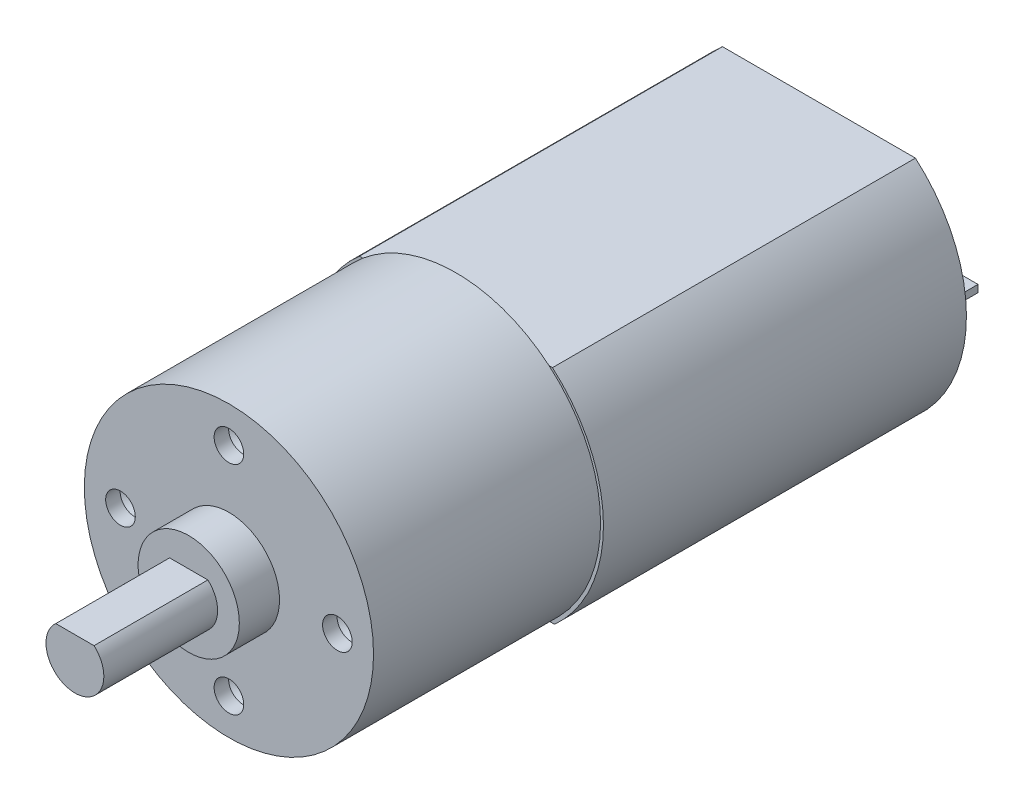
ISO-10303-21;
HEADER;
FILE_DESCRIPTION(('STEP AP214'),'2;1');
FILE_NAME('part.step','',(''),(''),'','','');
FILE_SCHEMA(('AUTOMOTIVE_DESIGN { 1 0 10303 214 1 1 1 1 }'));
ENDSEC;
DATA;
#1=APPLICATION_CONTEXT('core data for automotive mechanical design processes');
#2=APPLICATION_PROTOCOL_DEFINITION('international standard','automotive_design',2000,#1);
#3=PRODUCT_CONTEXT('',#1,'mechanical');
#4=PRODUCT('Part','Part','',(#3));
#5=PRODUCT_RELATED_PRODUCT_CATEGORY('part','',(#4));
#6=PRODUCT_DEFINITION_FORMATION('','',#4);
#7=PRODUCT_DEFINITION_CONTEXT('part definition',#1,'design');
#8=PRODUCT_DEFINITION('design','',#6,#7);
#9=PRODUCT_DEFINITION_SHAPE('','',#8);
#10=(LENGTH_UNIT() NAMED_UNIT(*) SI_UNIT(.MILLI.,.METRE.));
#11=(NAMED_UNIT(*) PLANE_ANGLE_UNIT() SI_UNIT($,.RADIAN.));
#12=(NAMED_UNIT(*) SI_UNIT($,.STERADIAN.) SOLID_ANGLE_UNIT());
#13=UNCERTAINTY_MEASURE_WITH_UNIT(LENGTH_MEASURE(1.E-05),#10,'distance_accuracy_value','');
#14=(GEOMETRIC_REPRESENTATION_CONTEXT(3) GLOBAL_UNCERTAINTY_ASSIGNED_CONTEXT((#13)) GLOBAL_UNIT_ASSIGNED_CONTEXT((#10,
#11,#12)) REPRESENTATION_CONTEXT('',''));
#15=CARTESIAN_POINT('',(0.,0.,0.));
#16=DIRECTION('',(0.,0.,1.));
#17=DIRECTION('',(1.,0.,0.));
#18=AXIS2_PLACEMENT_3D('',#15,#16,#17);
#19=CARTESIAN_POINT('',(0.,-0.0637574717630147,-25.1));
#20=DIRECTION('',(0.,0.,-1.));
#21=DIRECTION('',(-1.,0.,0.));
#22=AXIS2_PLACEMENT_3D('',#19,#20,#21);
#23=PLANE('',#22);
#24=DIRECTION('',(-1.,0.,0.));
#25=VECTOR('',#24,1.);
#26=CARTESIAN_POINT('',(6.64,-0.249999999999998,-25.1));
#27=LINE('',#26,#25);
#28=CARTESIAN_POINT('',(9.,-0.249999999999999,-25.1));
#29=VERTEX_POINT('',#28);
#30=CARTESIAN_POINT('',(6.64,-0.249999999999998,-25.1));
#31=VERTEX_POINT('',#30);
#32=EDGE_CURVE('E243',#29,#31,#27,.T.);
#33=ORIENTED_EDGE('',*,*,#32,.F.);
#34=DIRECTION('',(0.,-1.,0.));
#35=VECTOR('',#34,1.);
#36=CARTESIAN_POINT('',(9.,-0.249999999999999,-25.1));
#37=LINE('',#36,#35);
#38=CARTESIAN_POINT('',(9.,0.250000000000001,-25.1));
#39=VERTEX_POINT('',#38);
#40=EDGE_CURVE('E229',#39,#29,#37,.T.);
#41=ORIENTED_EDGE('',*,*,#40,.F.);
#42=DIRECTION('',(1.,0.,0.));
#43=VECTOR('',#42,1.);
#44=CARTESIAN_POINT('',(6.64,0.250000000000002,-25.1));
#45=LINE('',#44,#43);
#46=CARTESIAN_POINT('',(6.64,0.250000000000002,-25.1));
#47=VERTEX_POINT('',#46);
#48=EDGE_CURVE('E234',#47,#39,#45,.T.);
#49=ORIENTED_EDGE('',*,*,#48,.F.);
#50=DIRECTION('',(0.,1.,0.));
#51=VECTOR('',#50,1.);
#52=CARTESIAN_POINT('',(6.64,-0.249999999999998,-25.1));
#53=LINE('',#52,#51);
#54=EDGE_CURVE('E245',#31,#47,#53,.T.);
#55=ORIENTED_EDGE('',*,*,#54,.F.);
#56=EDGE_LOOP('',(#33,#41,#49,#55));
#57=FACE_BOUND('',#56,.T.);
#58=CARTESIAN_POINT('',(0.,-0.0637574717630147,-25.1));
#59=DIRECTION('',(0.,0.,-1.));
#60=DIRECTION('',(-1.,0.,0.));
#61=AXIS2_PLACEMENT_3D('',#58,#59,#60);
#62=CIRCLE('',#61,10.20045545372);
#63=CARTESIAN_POINT('',(6.67437166556878,7.65,-25.1));
#64=VERTEX_POINT('',#63);
#65=CARTESIAN_POINT('',(6.81896002086063,-7.65,-25.1));
#66=VERTEX_POINT('',#65);
#67=EDGE_CURVE('E284',#64,#66,#62,.T.);
#68=ORIENTED_EDGE('',*,*,#67,.T.);
#69=DIRECTION('',(-1.,0.,0.));
#70=VECTOR('',#69,1.);
#71=CARTESIAN_POINT('',(6.81896002086063,-7.65,-25.1));
#72=LINE('',#71,#70);
#73=CARTESIAN_POINT('',(-6.81896002086062,-7.65,-25.1));
#74=VERTEX_POINT('',#73);
#75=EDGE_CURVE('E287',#66,#74,#72,.T.);
#76=ORIENTED_EDGE('',*,*,#75,.T.);
#77=CARTESIAN_POINT('',(0.,-0.0637574717630147,-25.1));
#78=DIRECTION('',(0.,0.,-1.));
#79=DIRECTION('',(-1.,0.,0.));
#80=AXIS2_PLACEMENT_3D('',#77,#78,#79);
#81=CIRCLE('',#80,10.20045545372);
#82=CARTESIAN_POINT('',(-6.67437166556877,7.65,-25.1));
#83=VERTEX_POINT('',#82);
#84=EDGE_CURVE('E289',#74,#83,#81,.T.);
#85=ORIENTED_EDGE('',*,*,#84,.T.);
#86=DIRECTION('',(1.,0.,0.));
#87=VECTOR('',#86,1.);
#88=CARTESIAN_POINT('',(6.67437166556878,7.65,-25.1));
#89=LINE('',#88,#87);
#90=EDGE_CURVE('E291',#83,#64,#89,.T.);
#91=ORIENTED_EDGE('',*,*,#90,.T.);
#92=EDGE_LOOP('',(#68,#76,#85,#91));
#93=FACE_BOUND('',#92,.T.);
#94=CARTESIAN_POINT('',(0.,0.,-25.1));
#95=DIRECTION('',(0.,0.,-1.));
#96=DIRECTION('',(-1.,0.,0.));
#97=AXIS2_PLACEMENT_3D('',#94,#95,#96);
#98=CIRCLE('',#97,3.02);
#99=CARTESIAN_POINT('',(-3.02,0.,-25.1));
#100=VERTEX_POINT('',#99);
#101=EDGE_CURVE('E256',#100,#100,#98,.T.);
#102=ORIENTED_EDGE('',*,*,#101,.F.);
#103=EDGE_LOOP('',(#102));
#104=FACE_BOUND('',#103,.T.);
#105=DIRECTION('',(-1.,0.,0.));
#106=VECTOR('',#105,1.);
#107=CARTESIAN_POINT('',(-6.64,-0.249999999999998,-25.1));
#108=LINE('',#107,#106);
#109=CARTESIAN_POINT('',(-6.64,-0.249999999999998,-25.1));
#110=VERTEX_POINT('',#109);
#111=CARTESIAN_POINT('',(-9.,-0.249999999999999,-25.1));
#112=VERTEX_POINT('',#111);
#113=EDGE_CURVE('E216',#110,#112,#108,.T.);
#114=ORIENTED_EDGE('',*,*,#113,.F.);
#115=DIRECTION('',(0.,-1.,0.));
#116=VECTOR('',#115,1.);
#117=CARTESIAN_POINT('',(-6.64,-0.249999999999998,-25.1));
#118=LINE('',#117,#116);
#119=CARTESIAN_POINT('',(-6.64,0.250000000000002,-25.1));
#120=VERTEX_POINT('',#119);
#121=EDGE_CURVE('E202',#120,#110,#118,.T.);
#122=ORIENTED_EDGE('',*,*,#121,.F.);
#123=DIRECTION('',(1.,0.,0.));
#124=VECTOR('',#123,1.);
#125=CARTESIAN_POINT('',(-6.64,0.250000000000002,-25.1));
#126=LINE('',#125,#124);
#127=CARTESIAN_POINT('',(-9.,0.250000000000001,-25.1));
#128=VERTEX_POINT('',#127);
#129=EDGE_CURVE('E207',#128,#120,#126,.T.);
#130=ORIENTED_EDGE('',*,*,#129,.F.);
#131=DIRECTION('',(0.,1.,0.));
#132=VECTOR('',#131,1.);
#133=CARTESIAN_POINT('',(-9.,-0.249999999999999,-25.1));
#134=LINE('',#133,#132);
#135=EDGE_CURVE('E218',#112,#128,#134,.T.);
#136=ORIENTED_EDGE('',*,*,#135,.F.);
#137=EDGE_LOOP('',(#114,#122,#130,#136));
#138=FACE_BOUND('',#137,.T.);
#139=ADVANCED_FACE('F40',(#57,#93,#104,#138),#23,.T.);
#140=CARTESIAN_POINT('',(0.,0.,18.48));
#141=DIRECTION('',(0.,0.,1.));
#142=DIRECTION('',(1.,0.,0.));
#143=AXIS2_PLACEMENT_3D('',#140,#141,#142);
#144=PLANE('',#143);
#145=CARTESIAN_POINT('',(0.,0.,18.48));
#146=DIRECTION('',(0.,0.,1.));
#147=DIRECTION('',(1.,0.,0.));
#148=AXIS2_PLACEMENT_3D('',#145,#146,#147);
#149=CIRCLE('',#148,3.5);
#150=CARTESIAN_POINT('',(3.5,0.,18.48));
#151=VERTEX_POINT('',#150);
#152=EDGE_CURVE('E278',#151,#151,#149,.T.);
#153=ORIENTED_EDGE('',*,*,#152,.T.);
#154=EDGE_LOOP('',(#153));
#155=FACE_BOUND('',#154,.T.);
#156=DIRECTION('',(-1.,0.,0.));
#157=VECTOR('',#156,1.);
#158=CARTESIAN_POINT('',(-1.3228756555323,1.5,18.48));
#159=LINE('',#158,#157);
#160=CARTESIAN_POINT('',(1.3228756555323,1.5,18.48));
#161=VERTEX_POINT('',#160);
#162=CARTESIAN_POINT('',(-1.3228756555323,1.5,18.48));
#163=VERTEX_POINT('',#162);
#164=EDGE_CURVE('E267',#161,#163,#159,.T.);
#165=ORIENTED_EDGE('',*,*,#164,.F.);
#166=CARTESIAN_POINT('',(0.,0.,18.48));
#167=DIRECTION('',(0.,0.,1.));
#168=DIRECTION('',(1.,0.,0.));
#169=AXIS2_PLACEMENT_3D('',#166,#167,#168);
#170=CIRCLE('',#169,2.);
#171=EDGE_CURVE('E260',#163,#161,#170,.T.);
#172=ORIENTED_EDGE('',*,*,#171,.F.);
#173=EDGE_LOOP('',(#165,#172));
#174=FACE_BOUND('',#173,.T.);
#175=ADVANCED_FACE('F355',(#155,#174),#144,.T.);
#176=CARTESIAN_POINT('',(0.,0.,15.7));
#177=DIRECTION('',(0.,0.,1.));
#178=DIRECTION('',(1.,0.,0.));
#179=AXIS2_PLACEMENT_3D('',#176,#177,#178);
#180=PLANE('',#179);
#181=CARTESIAN_POINT('',(-7.5,0.,15.7));
#182=DIRECTION('',(0.,0.,1.));
#183=DIRECTION('',(1.,0.,0.));
#184=AXIS2_PLACEMENT_3D('',#181,#182,#183);
#185=CIRCLE('',#184,1.025);
#186=CARTESIAN_POINT('',(-6.475,0.,15.7));
#187=VERTEX_POINT('',#186);
#188=EDGE_CURVE('E180',#187,#187,#185,.T.);
#189=ORIENTED_EDGE('',*,*,#188,.F.);
#190=EDGE_LOOP('',(#189));
#191=FACE_BOUND('',#190,.T.);
#192=CARTESIAN_POINT('',(7.5,0.,15.7));
#193=DIRECTION('',(0.,0.,1.));
#194=DIRECTION('',(1.,0.,0.));
#195=AXIS2_PLACEMENT_3D('',#192,#193,#194);
#196=CIRCLE('',#195,1.025);
#197=CARTESIAN_POINT('',(8.525,0.,15.7));
#198=VERTEX_POINT('',#197);
#199=EDGE_CURVE('E179',#198,#198,#196,.T.);
#200=ORIENTED_EDGE('',*,*,#199,.F.);
#201=EDGE_LOOP('',(#200));
#202=FACE_BOUND('',#201,.T.);
#203=CARTESIAN_POINT('',(0.,7.5,15.7));
#204=DIRECTION('',(0.,0.,1.));
#205=DIRECTION('',(1.,0.,0.));
#206=AXIS2_PLACEMENT_3D('',#203,#204,#205);
#207=CIRCLE('',#206,1.025);
#208=CARTESIAN_POINT('',(1.025,7.5,15.7));
#209=VERTEX_POINT('',#208);
#210=EDGE_CURVE('E190',#209,#209,#207,.T.);
#211=ORIENTED_EDGE('',*,*,#210,.F.);
#212=EDGE_LOOP('',(#211));
#213=FACE_BOUND('',#212,.T.);
#214=CARTESIAN_POINT('',(0.,-7.5,15.7));
#215=DIRECTION('',(0.,0.,1.));
#216=DIRECTION('',(1.,0.,0.));
#217=AXIS2_PLACEMENT_3D('',#214,#215,#216);
#218=CIRCLE('',#217,1.025);
#219=CARTESIAN_POINT('',(1.025,-7.5,15.7));
#220=VERTEX_POINT('',#219);
#221=EDGE_CURVE('E196',#220,#220,#218,.T.);
#222=ORIENTED_EDGE('',*,*,#221,.F.);
#223=EDGE_LOOP('',(#222));
#224=FACE_BOUND('',#223,.T.);
#225=CARTESIAN_POINT('',(0.,0.,15.7));
#226=DIRECTION('',(0.,0.,1.));
#227=DIRECTION('',(1.,0.,0.));
#228=AXIS2_PLACEMENT_3D('',#225,#226,#227);
#229=CIRCLE('',#228,10.);
#230=CARTESIAN_POINT('',(10.,0.,15.7));
#231=VERTEX_POINT('',#230);
#232=EDGE_CURVE('E314',#231,#231,#229,.T.);
#233=ORIENTED_EDGE('',*,*,#232,.T.);
#234=EDGE_LOOP('',(#233));
#235=FACE_BOUND('',#234,.T.);
#236=CARTESIAN_POINT('',(0.,0.,15.7));
#237=DIRECTION('',(0.,0.,1.));
#238=DIRECTION('',(1.,0.,0.));
#239=AXIS2_PLACEMENT_3D('',#236,#237,#238);
#240=CIRCLE('',#239,3.5);
#241=CARTESIAN_POINT('',(3.5,0.,15.7));
#242=VERTEX_POINT('',#241);
#243=EDGE_CURVE('E277',#242,#242,#240,.T.);
#244=ORIENTED_EDGE('',*,*,#243,.F.);
#245=EDGE_LOOP('',(#244));
#246=FACE_BOUND('',#245,.T.);
#247=ADVANCED_FACE('F350',(#191,#202,#213,#224,#235,#246),#180,.T.);
#248=CARTESIAN_POINT('',(0.,0.,0.));
#249=DIRECTION('',(0.,0.,1.));
#250=DIRECTION('',(1.,0.,0.));
#251=AXIS2_PLACEMENT_3D('',#248,#249,#250);
#252=PLANE('',#251);
#253=DIRECTION('',(1.,0.,0.));
#254=VECTOR('',#253,1.);
#255=CARTESIAN_POINT('',(6.67437166556878,7.65,0.));
#256=LINE('',#255,#254);
#257=CARTESIAN_POINT('',(-6.440302787913,7.65,0.));
#258=VERTEX_POINT('',#257);
#259=CARTESIAN_POINT('',(6.440302787913,7.65,0.));
#260=VERTEX_POINT('',#259);
#261=EDGE_CURVE('E12',#258,#260,#256,.T.);
#262=ORIENTED_EDGE('',*,*,#261,.F.);
#263=CARTESIAN_POINT('',(0.,0.,0.));
#264=DIRECTION('',(0.,0.,1.));
#265=DIRECTION('',(1.,0.,0.));
#266=AXIS2_PLACEMENT_3D('',#263,#264,#265);
#267=CIRCLE('',#266,10.);
#268=EDGE_CURVE('E44',#260,#258,#267,.T.);
#269=ORIENTED_EDGE('',*,*,#268,.F.);
#270=EDGE_LOOP('',(#262,#269));
#271=FACE_BOUND('',#270,.T.);
#272=ADVANCED_FACE('F347',(#271),#252,.F.);
#273=DIRECTION('',(-1.,0.,0.));
#274=VECTOR('',#273,1.);
#275=CARTESIAN_POINT('',(6.81896002086063,-7.65,0.));
#276=LINE('',#275,#274);
#277=CARTESIAN_POINT('',(6.440302787913,-7.65,0.));
#278=VERTEX_POINT('',#277);
#279=CARTESIAN_POINT('',(-6.44030278791301,-7.65,0.));
#280=VERTEX_POINT('',#279);
#281=EDGE_CURVE('E49',#278,#280,#276,.T.);
#282=ORIENTED_EDGE('',*,*,#281,.F.);
#283=EDGE_CURVE('E324',#280,#278,#267,.T.);
#284=ORIENTED_EDGE('',*,*,#283,.F.);
#285=EDGE_LOOP('',(#282,#284));
#286=FACE_BOUND('',#285,.T.);
#287=ADVANCED_FACE('F349',(#286),#252,.F.);
#288=CARTESIAN_POINT('',(0.,0.,15.7));
#289=DIRECTION('',(0.,0.,-1.));
#290=DIRECTION('',(-1.,0.,0.));
#291=AXIS2_PLACEMENT_3D('',#288,#289,#290);
#292=CYLINDRICAL_SURFACE('',#291,10.);
#293=ORIENTED_EDGE('',*,*,#232,.F.);
#294=EDGE_LOOP('',(#293));
#295=FACE_BOUND('',#294,.T.);
#296=ORIENTED_EDGE('',*,*,#268,.T.);
#297=EDGE_CURVE('E320',#258,#280,#267,.T.);
#298=ORIENTED_EDGE('',*,*,#297,.T.);
#299=ORIENTED_EDGE('',*,*,#283,.T.);
#300=EDGE_CURVE('E313',#278,#260,#267,.T.);
#301=ORIENTED_EDGE('',*,*,#300,.T.);
#302=EDGE_LOOP('',(#296,#298,#299,#301));
#303=FACE_BOUND('',#302,.T.);
#304=ADVANCED_FACE('F42',(#295,#303),#292,.T.);
#305=CARTESIAN_POINT('',(0.,-0.0637574717630147,0.));
#306=DIRECTION('',(0.,0.,-1.));
#307=DIRECTION('',(-1.,0.,0.));
#308=AXIS2_PLACEMENT_3D('',#305,#306,#307);
#309=PLANE('',#308);
#310=ORIENTED_EDGE('',*,*,#297,.F.);
#311=CARTESIAN_POINT('',(-6.67437166556877,7.65,0.));
#312=VERTEX_POINT('',#311);
#313=EDGE_CURVE('E51',#312,#258,#256,.T.);
#314=ORIENTED_EDGE('',*,*,#313,.F.);
#315=CARTESIAN_POINT('',(0.,-0.0637574717630147,0.));
#316=DIRECTION('',(0.,0.,-1.));
#317=DIRECTION('',(-1.,0.,0.));
#318=AXIS2_PLACEMENT_3D('',#315,#316,#317);
#319=CIRCLE('',#318,10.20045545372);
#320=CARTESIAN_POINT('',(-6.81896002086062,-7.65,0.));
#321=VERTEX_POINT('',#320);
#322=EDGE_CURVE('E300',#321,#312,#319,.T.);
#323=ORIENTED_EDGE('',*,*,#322,.F.);
#324=EDGE_CURVE('E296',#280,#321,#276,.T.);
#325=ORIENTED_EDGE('',*,*,#324,.F.);
#326=EDGE_LOOP('',(#310,#314,#323,#325));
#327=FACE_BOUND('',#326,.T.);
#328=ADVANCED_FACE('F373',(#327),#309,.F.);
#329=CARTESIAN_POINT('',(0.,-0.0637574717630147,-25.1));
#330=DIRECTION('',(0.,0.,1.));
#331=DIRECTION('',(1.,0.,0.));
#332=AXIS2_PLACEMENT_3D('',#329,#330,#331);
#333=CYLINDRICAL_SURFACE('',#332,10.20045545372);
#334=CARTESIAN_POINT('',(0.,-0.0637574717630147,0.));
#335=DIRECTION('',(0.,0.,-1.));
#336=DIRECTION('',(-1.,0.,0.));
#337=AXIS2_PLACEMENT_3D('',#334,#335,#336);
#338=CIRCLE('',#337,10.20045545372);
#339=CARTESIAN_POINT('',(6.67437166556878,7.65,0.));
#340=VERTEX_POINT('',#339);
#341=CARTESIAN_POINT('',(6.81896002086063,-7.65,0.));
#342=VERTEX_POINT('',#341);
#343=EDGE_CURVE('E281',#340,#342,#338,.T.);
#344=ORIENTED_EDGE('',*,*,#343,.T.);
#345=DIRECTION('',(0.,0.,1.));
#346=VECTOR('',#345,1.);
#347=CARTESIAN_POINT('',(6.81896002086063,-7.65,-25.1));
#348=LINE('',#347,#346);
#349=EDGE_CURVE('E311',#66,#342,#348,.T.);
#350=ORIENTED_EDGE('',*,*,#349,.F.);
#351=ORIENTED_EDGE('',*,*,#67,.F.);
#352=DIRECTION('',(0.,0.,1.));
#353=VECTOR('',#352,1.);
#354=CARTESIAN_POINT('',(6.67437166556878,7.65,-25.1));
#355=LINE('',#354,#353);
#356=EDGE_CURVE('E293',#64,#340,#355,.T.);
#357=ORIENTED_EDGE('',*,*,#356,.T.);
#358=EDGE_LOOP('',(#344,#350,#351,#357));
#359=FACE_BOUND('',#358,.T.);
#360=ADVANCED_FACE('F340',(#359),#333,.T.);
#361=CARTESIAN_POINT('',(6.81896002086063,-7.65,-25.1));
#362=DIRECTION('',(0.,1.,0.));
#363=DIRECTION('',(-1.,0.,0.));
#364=AXIS2_PLACEMENT_3D('',#361,#362,#363);
#365=PLANE('',#364);
#366=EDGE_CURVE('E297',#342,#278,#276,.T.);
#367=ORIENTED_EDGE('',*,*,#366,.T.);
#368=ORIENTED_EDGE('',*,*,#281,.T.);
#369=ORIENTED_EDGE('',*,*,#324,.T.);
#370=DIRECTION('',(0.,0.,1.));
#371=VECTOR('',#370,1.);
#372=CARTESIAN_POINT('',(-6.81896002086062,-7.65,-25.1));
#373=LINE('',#372,#371);
#374=EDGE_CURVE('E308',#74,#321,#373,.T.);
#375=ORIENTED_EDGE('',*,*,#374,.F.);
#376=ORIENTED_EDGE('',*,*,#75,.F.);
#377=ORIENTED_EDGE('',*,*,#349,.T.);
#378=EDGE_LOOP('',(#367,#368,#369,#375,#376,#377));
#379=FACE_BOUND('',#378,.T.);
#380=ADVANCED_FACE('F335',(#379),#365,.F.);
#381=CARTESIAN_POINT('',(0.,-0.0637574717630147,-25.1));
#382=DIRECTION('',(0.,0.,1.));
#383=DIRECTION('',(1.,0.,0.));
#384=AXIS2_PLACEMENT_3D('',#381,#382,#383);
#385=CYLINDRICAL_SURFACE('',#384,10.20045545372);
#386=ORIENTED_EDGE('',*,*,#322,.T.);
#387=DIRECTION('',(0.,0.,1.));
#388=VECTOR('',#387,1.);
#389=CARTESIAN_POINT('',(-6.67437166556877,7.65,-25.1));
#390=LINE('',#389,#388);
#391=EDGE_CURVE('E305',#83,#312,#390,.T.);
#392=ORIENTED_EDGE('',*,*,#391,.F.);
#393=ORIENTED_EDGE('',*,*,#84,.F.);
#394=ORIENTED_EDGE('',*,*,#374,.T.);
#395=EDGE_LOOP('',(#386,#392,#393,#394));
#396=FACE_BOUND('',#395,.T.);
#397=ADVANCED_FACE('F376',(#396),#385,.T.);
#398=CARTESIAN_POINT('',(6.67437166556878,7.65,-25.1));
#399=DIRECTION('',(0.,-1.,0.));
#400=DIRECTION('',(1.,0.,0.));
#401=AXIS2_PLACEMENT_3D('',#398,#399,#400);
#402=PLANE('',#401);
#403=ORIENTED_EDGE('',*,*,#313,.T.);
#404=ORIENTED_EDGE('',*,*,#261,.T.);
#405=EDGE_CURVE('E52',#260,#340,#256,.T.);
#406=ORIENTED_EDGE('',*,*,#405,.T.);
#407=ORIENTED_EDGE('',*,*,#356,.F.);
#408=ORIENTED_EDGE('',*,*,#90,.F.);
#409=ORIENTED_EDGE('',*,*,#391,.T.);
#410=EDGE_LOOP('',(#403,#404,#406,#407,#408,#409));
#411=FACE_BOUND('',#410,.T.);
#412=ADVANCED_FACE('F344',(#411),#402,.F.);
#413=ORIENTED_EDGE('',*,*,#300,.F.);
#414=ORIENTED_EDGE('',*,*,#366,.F.);
#415=ORIENTED_EDGE('',*,*,#343,.F.);
#416=ORIENTED_EDGE('',*,*,#405,.F.);
#417=EDGE_LOOP('',(#413,#414,#415,#416));
#418=FACE_BOUND('',#417,.T.);
#419=ADVANCED_FACE('F332',(#418),#309,.F.);
#420=CARTESIAN_POINT('',(0.,0.,18.48));
#421=DIRECTION('',(0.,0.,-1.));
#422=DIRECTION('',(-1.,0.,0.));
#423=AXIS2_PLACEMENT_3D('',#420,#421,#422);
#424=CYLINDRICAL_SURFACE('',#423,3.5);
#425=ORIENTED_EDGE('',*,*,#152,.F.);
#426=EDGE_LOOP('',(#425));
#427=FACE_BOUND('',#426,.T.);
#428=ORIENTED_EDGE('',*,*,#243,.T.);
#429=EDGE_LOOP('',(#428));
#430=FACE_BOUND('',#429,.T.);
#431=ADVANCED_FACE('F370',(#427,#430),#424,.T.);
#432=CARTESIAN_POINT('',(0.,0.,26.35));
#433=DIRECTION('',(0.,0.,-1.));
#434=DIRECTION('',(-1.,0.,0.));
#435=AXIS2_PLACEMENT_3D('',#432,#433,#434);
#436=CYLINDRICAL_SURFACE('',#435,2.);
#437=ORIENTED_EDGE('',*,*,#171,.T.);
#438=DIRECTION('',(0.,0.,-1.));
#439=VECTOR('',#438,1.);
#440=CARTESIAN_POINT('',(1.3228756555323,1.5,26.35));
#441=LINE('',#440,#439);
#442=CARTESIAN_POINT('',(1.3228756555323,1.5,26.35));
#443=VERTEX_POINT('',#442);
#444=EDGE_CURVE('E274',#443,#161,#441,.T.);
#445=ORIENTED_EDGE('',*,*,#444,.F.);
#446=CARTESIAN_POINT('',(0.,0.,26.35));
#447=DIRECTION('',(0.,0.,1.));
#448=DIRECTION('',(1.,0.,0.));
#449=AXIS2_PLACEMENT_3D('',#446,#447,#448);
#450=CIRCLE('',#449,2.);
#451=CARTESIAN_POINT('',(-1.3228756555323,1.5,26.35));
#452=VERTEX_POINT('',#451);
#453=EDGE_CURVE('E263',#452,#443,#450,.T.);
#454=ORIENTED_EDGE('',*,*,#453,.F.);
#455=DIRECTION('',(0.,0.,-1.));
#456=VECTOR('',#455,1.);
#457=CARTESIAN_POINT('',(-1.3228756555323,1.5,26.35));
#458=LINE('',#457,#456);
#459=EDGE_CURVE('E269',#452,#163,#458,.T.);
#460=ORIENTED_EDGE('',*,*,#459,.T.);
#461=EDGE_LOOP('',(#437,#445,#454,#460));
#462=FACE_BOUND('',#461,.T.);
#463=ADVANCED_FACE('F464',(#462),#436,.T.);
#464=CARTESIAN_POINT('',(-1.3228756555323,1.5,26.35));
#465=DIRECTION('',(0.,-1.,0.));
#466=DIRECTION('',(0.,0.,-1.));
#467=AXIS2_PLACEMENT_3D('',#464,#465,#466);
#468=PLANE('',#467);
#469=ORIENTED_EDGE('',*,*,#164,.T.);
#470=ORIENTED_EDGE('',*,*,#459,.F.);
#471=DIRECTION('',(-1.,0.,0.));
#472=VECTOR('',#471,1.);
#473=CARTESIAN_POINT('',(-1.3228756555323,1.5,26.35));
#474=LINE('',#473,#472);
#475=EDGE_CURVE('E266',#443,#452,#474,.T.);
#476=ORIENTED_EDGE('',*,*,#475,.F.);
#477=ORIENTED_EDGE('',*,*,#444,.T.);
#478=EDGE_LOOP('',(#469,#470,#476,#477));
#479=FACE_BOUND('',#478,.T.);
#480=ADVANCED_FACE('F460',(#479),#468,.F.);
#481=CARTESIAN_POINT('',(0.,0.,26.35));
#482=DIRECTION('',(0.,0.,1.));
#483=DIRECTION('',(1.,0.,0.));
#484=AXIS2_PLACEMENT_3D('',#481,#482,#483);
#485=PLANE('',#484);
#486=ORIENTED_EDGE('',*,*,#453,.T.);
#487=ORIENTED_EDGE('',*,*,#475,.T.);
#488=EDGE_LOOP('',(#486,#487));
#489=FACE_BOUND('',#488,.T.);
#490=ADVANCED_FACE('F456',(#489),#485,.T.);
#491=CARTESIAN_POINT('',(0.,0.,-26.96));
#492=DIRECTION('',(0.,0.,1.));
#493=DIRECTION('',(1.,0.,0.));
#494=AXIS2_PLACEMENT_3D('',#491,#492,#493);
#495=CYLINDRICAL_SURFACE('',#494,3.02);
#496=CARTESIAN_POINT('',(0.,0.,-26.96));
#497=DIRECTION('',(0.,0.,-1.));
#498=DIRECTION('',(-1.,0.,0.));
#499=AXIS2_PLACEMENT_3D('',#496,#497,#498);
#500=CIRCLE('',#499,3.02);
#501=CARTESIAN_POINT('',(-3.02,0.,-26.96));
#502=VERTEX_POINT('',#501);
#503=EDGE_CURVE('E257',#502,#502,#500,.T.);
#504=ORIENTED_EDGE('',*,*,#503,.F.);
#505=EDGE_LOOP('',(#504));
#506=FACE_BOUND('',#505,.T.);
#507=ORIENTED_EDGE('',*,*,#101,.T.);
#508=EDGE_LOOP('',(#507));
#509=FACE_BOUND('',#508,.T.);
#510=ADVANCED_FACE('F452',(#506,#509),#495,.T.);
#511=CARTESIAN_POINT('',(0.,0.,-26.96));
#512=DIRECTION('',(0.,0.,-1.));
#513=DIRECTION('',(-1.,0.,0.));
#514=AXIS2_PLACEMENT_3D('',#511,#512,#513);
#515=PLANE('',#514);
#516=ORIENTED_EDGE('',*,*,#503,.T.);
#517=EDGE_LOOP('',(#516));
#518=FACE_BOUND('',#517,.T.);
#519=ADVANCED_FACE('F448',(#518),#515,.T.);
#520=CARTESIAN_POINT('',(9.,-0.249999999999999,-27.1));
#521=DIRECTION('',(-1.,0.,0.));
#522=DIRECTION('',(0.,0.,1.));
#523=AXIS2_PLACEMENT_3D('',#520,#521,#522);
#524=PLANE('',#523);
#525=ORIENTED_EDGE('',*,*,#40,.T.);
#526=DIRECTION('',(0.,0.,1.));
#527=VECTOR('',#526,1.);
#528=CARTESIAN_POINT('',(9.,-0.249999999999999,-27.1));
#529=LINE('',#528,#527);
#530=CARTESIAN_POINT('',(9.,-0.249999999999999,-27.1));
#531=VERTEX_POINT('',#530);
#532=EDGE_CURVE('E254',#531,#29,#529,.T.);
#533=ORIENTED_EDGE('',*,*,#532,.F.);
#534=DIRECTION('',(0.,-1.,0.));
#535=VECTOR('',#534,1.);
#536=CARTESIAN_POINT('',(9.,-0.249999999999999,-27.1));
#537=LINE('',#536,#535);
#538=CARTESIAN_POINT('',(9.,0.250000000000001,-27.1));
#539=VERTEX_POINT('',#538);
#540=EDGE_CURVE('E230',#539,#531,#537,.T.);
#541=ORIENTED_EDGE('',*,*,#540,.F.);
#542=DIRECTION('',(0.,0.,1.));
#543=VECTOR('',#542,1.);
#544=CARTESIAN_POINT('',(9.,0.250000000000001,-27.1));
#545=LINE('',#544,#543);
#546=EDGE_CURVE('E240',#539,#39,#545,.T.);
#547=ORIENTED_EDGE('',*,*,#546,.T.);
#548=EDGE_LOOP('',(#525,#533,#541,#547));
#549=FACE_BOUND('',#548,.T.);
#550=ADVANCED_FACE('F444',(#549),#524,.F.);
#551=CARTESIAN_POINT('',(6.64,-0.249999999999998,-27.1));
#552=DIRECTION('',(0.,1.,0.));
#553=DIRECTION('',(-1.,0.,0.));
#554=AXIS2_PLACEMENT_3D('',#551,#552,#553);
#555=PLANE('',#554);
#556=ORIENTED_EDGE('',*,*,#32,.T.);
#557=DIRECTION('',(0.,0.,1.));
#558=VECTOR('',#557,1.);
#559=CARTESIAN_POINT('',(6.64,-0.249999999999998,-27.1));
#560=LINE('',#559,#558);
#561=CARTESIAN_POINT('',(6.64,-0.249999999999998,-27.1));
#562=VERTEX_POINT('',#561);
#563=EDGE_CURVE('E251',#562,#31,#560,.T.);
#564=ORIENTED_EDGE('',*,*,#563,.F.);
#565=DIRECTION('',(-1.,0.,0.));
#566=VECTOR('',#565,1.);
#567=CARTESIAN_POINT('',(6.64,-0.249999999999998,-27.1));
#568=LINE('',#567,#566);
#569=EDGE_CURVE('E233',#531,#562,#568,.T.);
#570=ORIENTED_EDGE('',*,*,#569,.F.);
#571=ORIENTED_EDGE('',*,*,#532,.T.);
#572=EDGE_LOOP('',(#556,#564,#570,#571));
#573=FACE_BOUND('',#572,.T.);
#574=ADVANCED_FACE('F440',(#573),#555,.F.);
#575=CARTESIAN_POINT('',(6.64,-0.249999999999998,-27.1));
#576=DIRECTION('',(1.,0.,0.));
#577=DIRECTION('',(0.,0.,-1.));
#578=AXIS2_PLACEMENT_3D('',#575,#576,#577);
#579=PLANE('',#578);
#580=ORIENTED_EDGE('',*,*,#54,.T.);
#581=DIRECTION('',(0.,0.,1.));
#582=VECTOR('',#581,1.);
#583=CARTESIAN_POINT('',(6.64,0.250000000000002,-27.1));
#584=LINE('',#583,#582);
#585=CARTESIAN_POINT('',(6.64,0.250000000000002,-27.1));
#586=VERTEX_POINT('',#585);
#587=EDGE_CURVE('E67',#586,#47,#584,.T.);
#588=ORIENTED_EDGE('',*,*,#587,.F.);
#589=DIRECTION('',(0.,1.,0.));
#590=VECTOR('',#589,1.);
#591=CARTESIAN_POINT('',(6.64,-0.249999999999998,-27.1));
#592=LINE('',#591,#590);
#593=EDGE_CURVE('E236',#562,#586,#592,.T.);
#594=ORIENTED_EDGE('',*,*,#593,.F.);
#595=ORIENTED_EDGE('',*,*,#563,.T.);
#596=EDGE_LOOP('',(#580,#588,#594,#595));
#597=FACE_BOUND('',#596,.T.);
#598=ADVANCED_FACE('F437',(#597),#579,.F.);
#599=CARTESIAN_POINT('',(6.64,0.250000000000002,-27.1));
#600=DIRECTION('',(0.,-1.,0.));
#601=DIRECTION('',(1.,0.,0.));
#602=AXIS2_PLACEMENT_3D('',#599,#600,#601);
#603=PLANE('',#602);
#604=ORIENTED_EDGE('',*,*,#48,.T.);
#605=ORIENTED_EDGE('',*,*,#546,.F.);
#606=DIRECTION('',(1.,0.,0.));
#607=VECTOR('',#606,1.);
#608=CARTESIAN_POINT('',(6.64,0.250000000000002,-27.1));
#609=LINE('',#608,#607);
#610=EDGE_CURVE('E238',#586,#539,#609,.T.);
#611=ORIENTED_EDGE('',*,*,#610,.F.);
#612=ORIENTED_EDGE('',*,*,#587,.T.);
#613=EDGE_LOOP('',(#604,#605,#611,#612));
#614=FACE_BOUND('',#613,.T.);
#615=ADVANCED_FACE('F433',(#614),#603,.F.);
#616=CARTESIAN_POINT('',(0.,0.,-27.1));
#617=DIRECTION('',(0.,0.,-1.));
#618=DIRECTION('',(-1.,0.,0.));
#619=AXIS2_PLACEMENT_3D('',#616,#617,#618);
#620=PLANE('',#619);
#621=ORIENTED_EDGE('',*,*,#540,.T.);
#622=ORIENTED_EDGE('',*,*,#569,.T.);
#623=ORIENTED_EDGE('',*,*,#593,.T.);
#624=ORIENTED_EDGE('',*,*,#610,.T.);
#625=EDGE_LOOP('',(#621,#622,#623,#624));
#626=FACE_BOUND('',#625,.T.);
#627=ADVANCED_FACE('F430',(#626),#620,.T.);
#628=CARTESIAN_POINT('',(-6.64,-0.249999999999998,-27.1));
#629=DIRECTION('',(-1.,0.,0.));
#630=DIRECTION('',(0.,0.,1.));
#631=AXIS2_PLACEMENT_3D('',#628,#629,#630);
#632=PLANE('',#631);
#633=ORIENTED_EDGE('',*,*,#121,.T.);
#634=DIRECTION('',(0.,0.,1.));
#635=VECTOR('',#634,1.);
#636=CARTESIAN_POINT('',(-6.64,-0.249999999999998,-27.1));
#637=LINE('',#636,#635);
#638=CARTESIAN_POINT('',(-6.64,-0.249999999999998,-27.1));
#639=VERTEX_POINT('',#638);
#640=EDGE_CURVE('E227',#639,#110,#637,.T.);
#641=ORIENTED_EDGE('',*,*,#640,.F.);
#642=DIRECTION('',(0.,-1.,0.));
#643=VECTOR('',#642,1.);
#644=CARTESIAN_POINT('',(-6.64,-0.249999999999998,-27.1));
#645=LINE('',#644,#643);
#646=CARTESIAN_POINT('',(-6.64,0.250000000000002,-27.1));
#647=VERTEX_POINT('',#646);
#648=EDGE_CURVE('E203',#647,#639,#645,.T.);
#649=ORIENTED_EDGE('',*,*,#648,.F.);
#650=DIRECTION('',(0.,0.,1.));
#651=VECTOR('',#650,1.);
#652=CARTESIAN_POINT('',(-6.64,0.250000000000002,-27.1));
#653=LINE('',#652,#651);
#654=EDGE_CURVE('E213',#647,#120,#653,.T.);
#655=ORIENTED_EDGE('',*,*,#654,.T.);
#656=EDGE_LOOP('',(#633,#641,#649,#655));
#657=FACE_BOUND('',#656,.T.);
#658=ADVANCED_FACE('F413',(#657),#632,.F.);
#659=CARTESIAN_POINT('',(-6.64,-0.249999999999998,-27.1));
#660=DIRECTION('',(0.,1.,0.));
#661=DIRECTION('',(-1.,0.,0.));
#662=AXIS2_PLACEMENT_3D('',#659,#660,#661);
#663=PLANE('',#662);
#664=ORIENTED_EDGE('',*,*,#113,.T.);
#665=DIRECTION('',(0.,0.,1.));
#666=VECTOR('',#665,1.);
#667=CARTESIAN_POINT('',(-9.,-0.249999999999999,-27.1));
#668=LINE('',#667,#666);
#669=CARTESIAN_POINT('',(-9.,-0.249999999999999,-27.1));
#670=VERTEX_POINT('',#669);
#671=EDGE_CURVE('E224',#670,#112,#668,.T.);
#672=ORIENTED_EDGE('',*,*,#671,.F.);
#673=DIRECTION('',(-1.,0.,0.));
#674=VECTOR('',#673,1.);
#675=CARTESIAN_POINT('',(-6.64,-0.249999999999998,-27.1));
#676=LINE('',#675,#674);
#677=EDGE_CURVE('E206',#639,#670,#676,.T.);
#678=ORIENTED_EDGE('',*,*,#677,.F.);
#679=ORIENTED_EDGE('',*,*,#640,.T.);
#680=EDGE_LOOP('',(#664,#672,#678,#679));
#681=FACE_BOUND('',#680,.T.);
#682=ADVANCED_FACE('F403',(#681),#663,.F.);
#683=CARTESIAN_POINT('',(-9.,-0.249999999999999,-27.1));
#684=DIRECTION('',(1.,0.,0.));
#685=DIRECTION('',(0.,0.,-1.));
#686=AXIS2_PLACEMENT_3D('',#683,#684,#685);
#687=PLANE('',#686);
#688=ORIENTED_EDGE('',*,*,#135,.T.);
#689=DIRECTION('',(0.,0.,1.));
#690=VECTOR('',#689,1.);
#691=CARTESIAN_POINT('',(-9.,0.250000000000001,-27.1));
#692=LINE('',#691,#690);
#693=CARTESIAN_POINT('',(-9.,0.250000000000001,-27.1));
#694=VERTEX_POINT('',#693);
#695=EDGE_CURVE('E59',#694,#128,#692,.T.);
#696=ORIENTED_EDGE('',*,*,#695,.F.);
#697=DIRECTION('',(0.,1.,0.));
#698=VECTOR('',#697,1.);
#699=CARTESIAN_POINT('',(-9.,-0.249999999999999,-27.1));
#700=LINE('',#699,#698);
#701=EDGE_CURVE('E209',#670,#694,#700,.T.);
#702=ORIENTED_EDGE('',*,*,#701,.F.);
#703=ORIENTED_EDGE('',*,*,#671,.T.);
#704=EDGE_LOOP('',(#688,#696,#702,#703));
#705=FACE_BOUND('',#704,.T.);
#706=ADVANCED_FACE('F407',(#705),#687,.F.);
#707=CARTESIAN_POINT('',(-6.64,0.250000000000002,-27.1));
#708=DIRECTION('',(0.,-1.,0.));
#709=DIRECTION('',(1.,0.,0.));
#710=AXIS2_PLACEMENT_3D('',#707,#708,#709);
#711=PLANE('',#710);
#712=ORIENTED_EDGE('',*,*,#129,.T.);
#713=ORIENTED_EDGE('',*,*,#654,.F.);
#714=DIRECTION('',(1.,0.,0.));
#715=VECTOR('',#714,1.);
#716=CARTESIAN_POINT('',(-6.64,0.250000000000002,-27.1));
#717=LINE('',#716,#715);
#718=EDGE_CURVE('E211',#694,#647,#717,.T.);
#719=ORIENTED_EDGE('',*,*,#718,.F.);
#720=ORIENTED_EDGE('',*,*,#695,.T.);
#721=EDGE_LOOP('',(#712,#713,#719,#720));
#722=FACE_BOUND('',#721,.T.);
#723=ADVANCED_FACE('F414',(#722),#711,.F.);
#724=CARTESIAN_POINT('',(0.,0.,-27.1));
#725=DIRECTION('',(0.,0.,1.));
#726=DIRECTION('',(1.,0.,0.));
#727=AXIS2_PLACEMENT_3D('',#724,#725,#726);
#728=PLANE('',#727);
#729=ORIENTED_EDGE('',*,*,#648,.T.);
#730=ORIENTED_EDGE('',*,*,#677,.T.);
#731=ORIENTED_EDGE('',*,*,#701,.T.);
#732=ORIENTED_EDGE('',*,*,#718,.T.);
#733=EDGE_LOOP('',(#729,#730,#731,#732));
#734=FACE_BOUND('',#733,.T.);
#735=ADVANCED_FACE('F409',(#734),#728,.F.);
#736=CARTESIAN_POINT('',(0.,-7.5,14.7));
#737=DIRECTION('',(0.,0.,1.));
#738=DIRECTION('',(1.,0.,0.));
#739=AXIS2_PLACEMENT_3D('',#736,#737,#738);
#740=CONICAL_SURFACE('',#739,1.025,1.02974425867665);
#741=CARTESIAN_POINT('',(0.,-7.5,14.0841178654967));
#742=VERTEX_POINT('',#741);
#743=VERTEX_LOOP('',#742);
#744=FACE_BOUND('',#743,.T.);
#745=CARTESIAN_POINT('',(0.,-7.5,14.7));
#746=DIRECTION('',(0.,0.,1.));
#747=DIRECTION('',(1.,0.,0.));
#748=AXIS2_PLACEMENT_3D('',#745,#746,#747);
#749=CIRCLE('',#748,1.025);
#750=CARTESIAN_POINT('',(1.025,-7.5,14.7));
#751=VERTEX_POINT('',#750);
#752=EDGE_CURVE('E199',#751,#751,#749,.T.);
#753=ORIENTED_EDGE('',*,*,#752,.T.);
#754=EDGE_LOOP('',(#753));
#755=FACE_BOUND('',#754,.T.);
#756=ADVANCED_FACE('F421',(#744,#755),#740,.F.);
#757=CARTESIAN_POINT('',(0.,-7.5,15.7));
#758=DIRECTION('',(0.,0.,1.));
#759=DIRECTION('',(1.,0.,0.));
#760=AXIS2_PLACEMENT_3D('',#757,#758,#759);
#761=CYLINDRICAL_SURFACE('',#760,1.025);
#762=ORIENTED_EDGE('',*,*,#752,.F.);
#763=EDGE_LOOP('',(#762));
#764=FACE_BOUND('',#763,.T.);
#765=ORIENTED_EDGE('',*,*,#221,.T.);
#766=EDGE_LOOP('',(#765));
#767=FACE_BOUND('',#766,.T.);
#768=ADVANCED_FACE('F629',(#764,#767),#761,.F.);
#769=CARTESIAN_POINT('',(0.,7.5,14.7));
#770=DIRECTION('',(0.,0.,1.));
#771=DIRECTION('',(1.,0.,0.));
#772=AXIS2_PLACEMENT_3D('',#769,#770,#771);
#773=CONICAL_SURFACE('',#772,1.025,1.02974425867665);
#774=CARTESIAN_POINT('',(0.,7.5,14.0841178654967));
#775=VERTEX_POINT('',#774);
#776=VERTEX_LOOP('',#775);
#777=FACE_BOUND('',#776,.T.);
#778=CARTESIAN_POINT('',(0.,7.5,14.7));
#779=DIRECTION('',(0.,0.,1.));
#780=DIRECTION('',(1.,0.,0.));
#781=AXIS2_PLACEMENT_3D('',#778,#779,#780);
#782=CIRCLE('',#781,1.025);
#783=CARTESIAN_POINT('',(1.025,7.5,14.7));
#784=VERTEX_POINT('',#783);
#785=EDGE_CURVE('E193',#784,#784,#782,.T.);
#786=ORIENTED_EDGE('',*,*,#785,.T.);
#787=EDGE_LOOP('',(#786));
#788=FACE_BOUND('',#787,.T.);
#789=ADVANCED_FACE('F637',(#777,#788),#773,.F.);
#790=CARTESIAN_POINT('',(0.,7.5,15.7));
#791=DIRECTION('',(0.,0.,1.));
#792=DIRECTION('',(1.,0.,0.));
#793=AXIS2_PLACEMENT_3D('',#790,#791,#792);
#794=CYLINDRICAL_SURFACE('',#793,1.025);
#795=ORIENTED_EDGE('',*,*,#785,.F.);
#796=EDGE_LOOP('',(#795));
#797=FACE_BOUND('',#796,.T.);
#798=ORIENTED_EDGE('',*,*,#210,.T.);
#799=EDGE_LOOP('',(#798));
#800=FACE_BOUND('',#799,.T.);
#801=ADVANCED_FACE('F647',(#797,#800),#794,.F.);
#802=CARTESIAN_POINT('',(7.5,0.,14.7));
#803=DIRECTION('',(0.,0.,1.));
#804=DIRECTION('',(1.,0.,0.));
#805=AXIS2_PLACEMENT_3D('',#802,#803,#804);
#806=CONICAL_SURFACE('',#805,1.025,1.02974425867665);
#807=CARTESIAN_POINT('',(7.5,0.,14.0841178654967));
#808=VERTEX_POINT('',#807);
#809=VERTEX_LOOP('',#808);
#810=FACE_BOUND('',#809,.T.);
#811=CARTESIAN_POINT('',(7.5,0.,14.7));
#812=DIRECTION('',(0.,0.,1.));
#813=DIRECTION('',(1.,0.,0.));
#814=AXIS2_PLACEMENT_3D('',#811,#812,#813);
#815=CIRCLE('',#814,1.025);
#816=CARTESIAN_POINT('',(8.525,0.,14.7));
#817=VERTEX_POINT('',#816);
#818=EDGE_CURVE('E183',#817,#817,#815,.T.);
#819=ORIENTED_EDGE('',*,*,#818,.T.);
#820=EDGE_LOOP('',(#819));
#821=FACE_BOUND('',#820,.T.);
#822=ADVANCED_FACE('F656',(#810,#821),#806,.F.);
#823=CARTESIAN_POINT('',(7.5,0.,15.7));
#824=DIRECTION('',(0.,0.,1.));
#825=DIRECTION('',(1.,0.,0.));
#826=AXIS2_PLACEMENT_3D('',#823,#824,#825);
#827=CYLINDRICAL_SURFACE('',#826,1.025);
#828=ORIENTED_EDGE('',*,*,#818,.F.);
#829=EDGE_LOOP('',(#828));
#830=FACE_BOUND('',#829,.T.);
#831=ORIENTED_EDGE('',*,*,#199,.T.);
#832=EDGE_LOOP('',(#831));
#833=FACE_BOUND('',#832,.T.);
#834=ADVANCED_FACE('F173',(#830,#833),#827,.F.);
#835=CARTESIAN_POINT('',(-7.5,0.,14.7));
#836=DIRECTION('',(0.,0.,1.));
#837=DIRECTION('',(1.,0.,0.));
#838=AXIS2_PLACEMENT_3D('',#835,#836,#837);
#839=CONICAL_SURFACE('',#838,1.025,1.02974425867665);
#840=CARTESIAN_POINT('',(-7.5,0.,14.0841178654967));
#841=VERTEX_POINT('',#840);
#842=VERTEX_LOOP('',#841);
#843=FACE_BOUND('',#842,.T.);
#844=CARTESIAN_POINT('',(-7.5,0.,14.7));
#845=DIRECTION('',(0.,0.,1.));
#846=DIRECTION('',(1.,0.,0.));
#847=AXIS2_PLACEMENT_3D('',#844,#845,#846);
#848=CIRCLE('',#847,1.025);
#849=CARTESIAN_POINT('',(-6.475,0.,14.7));
#850=VERTEX_POINT('',#849);
#851=EDGE_CURVE('E177',#850,#850,#848,.T.);
#852=ORIENTED_EDGE('',*,*,#851,.T.);
#853=EDGE_LOOP('',(#852));
#854=FACE_BOUND('',#853,.T.);
#855=ADVANCED_FACE('F169',(#843,#854),#839,.F.);
#856=CARTESIAN_POINT('',(-7.5,0.,15.7));
#857=DIRECTION('',(0.,0.,1.));
#858=DIRECTION('',(1.,0.,0.));
#859=AXIS2_PLACEMENT_3D('',#856,#857,#858);
#860=CYLINDRICAL_SURFACE('',#859,1.025);
#861=ORIENTED_EDGE('',*,*,#851,.F.);
#862=EDGE_LOOP('',(#861));
#863=FACE_BOUND('',#862,.T.);
#864=ORIENTED_EDGE('',*,*,#188,.T.);
#865=EDGE_LOOP('',(#864));
#866=FACE_BOUND('',#865,.T.);
#867=ADVANCED_FACE('F172',(#863,#866),#860,.F.);
#868=CLOSED_SHELL('',(#139,#175,#247,#272,#287,#304,#328,#360,#380,#397,#412,#419,#431,#463,
#480,#490,#510,#519,#550,#574,#598,#615,#627,#658,#682,#706,#723,#735,#756,#768,#789,#801,#822,
#834,#855,#867));
#869=MANIFOLD_SOLID_BREP('B2',#868);
#870=ADVANCED_BREP_SHAPE_REPRESENTATION('',(#18,#869),#14);
#871=SHAPE_DEFINITION_REPRESENTATION(#9,#870);
ENDSEC;
END-ISO-10303-21;
